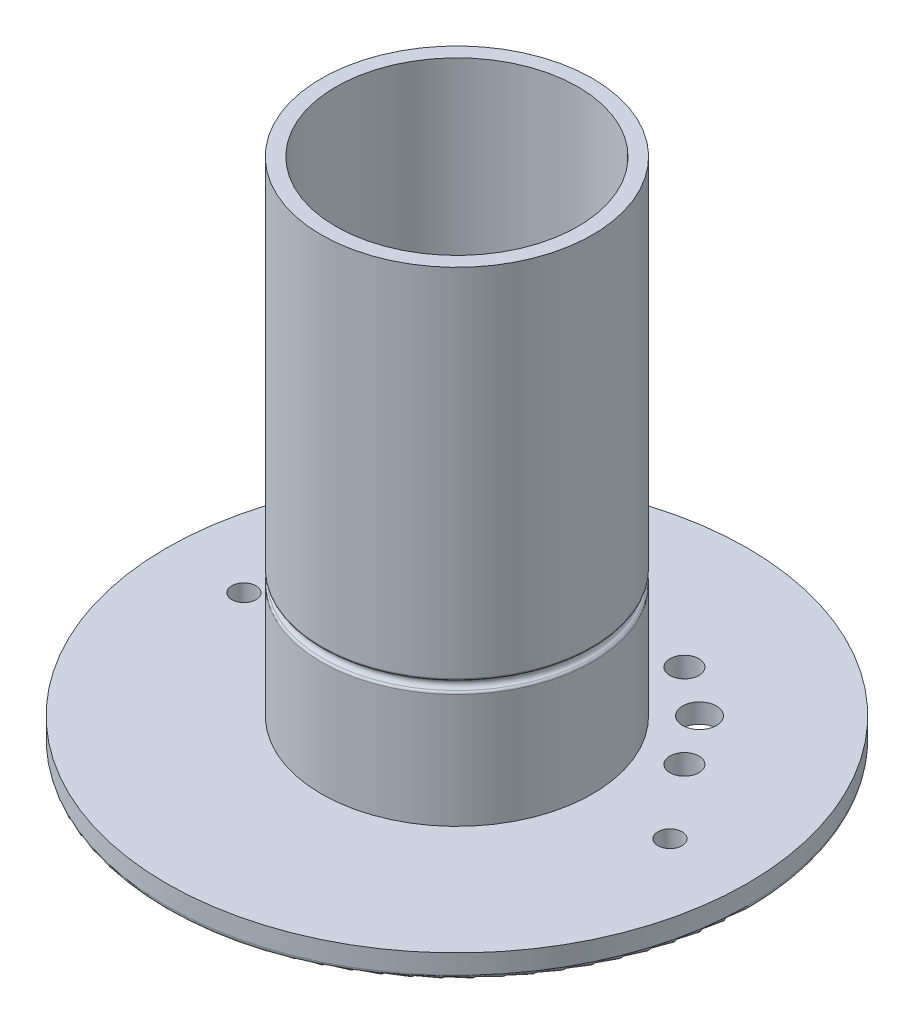
ISO-10303-21;
HEADER;
FILE_DESCRIPTION(('STEP AP214'),'2;1');
FILE_NAME('part.step','',(''),(''),'','','');
FILE_SCHEMA(('AUTOMOTIVE_DESIGN { 1 0 10303 214 1 1 1 1 }'));
ENDSEC;
DATA;
#1=APPLICATION_CONTEXT('core data for automotive mechanical design processes');
#2=APPLICATION_PROTOCOL_DEFINITION('international standard','automotive_design',2000,#1);
#3=PRODUCT_CONTEXT('',#1,'mechanical');
#4=PRODUCT('Part','Part','',(#3));
#5=PRODUCT_RELATED_PRODUCT_CATEGORY('part','',(#4));
#6=PRODUCT_DEFINITION_FORMATION('','',#4);
#7=PRODUCT_DEFINITION_CONTEXT('part definition',#1,'design');
#8=PRODUCT_DEFINITION('design','',#6,#7);
#9=PRODUCT_DEFINITION_SHAPE('','',#8);
#10=(LENGTH_UNIT() NAMED_UNIT(*) SI_UNIT(.MILLI.,.METRE.));
#11=(NAMED_UNIT(*) PLANE_ANGLE_UNIT() SI_UNIT($,.RADIAN.));
#12=(NAMED_UNIT(*) SI_UNIT($,.STERADIAN.) SOLID_ANGLE_UNIT());
#13=UNCERTAINTY_MEASURE_WITH_UNIT(LENGTH_MEASURE(1.E-05),#10,'distance_accuracy_value','');
#14=(GEOMETRIC_REPRESENTATION_CONTEXT(3) GLOBAL_UNCERTAINTY_ASSIGNED_CONTEXT((#13)) GLOBAL_UNIT_ASSIGNED_CONTEXT((#10,
#11,#12)) REPRESENTATION_CONTEXT('',''));
#15=CARTESIAN_POINT('',(0.,0.,0.));
#16=DIRECTION('',(0.,0.,1.));
#17=DIRECTION('',(1.,0.,0.));
#18=AXIS2_PLACEMENT_3D('',#15,#16,#17);
#19=CARTESIAN_POINT('',(-14.7905338401467,5.,-32.1906513456729));
#20=DIRECTION('',(0.,-1.,0.));
#21=DIRECTION('',(0.,0.,-1.));
#22=AXIS2_PLACEMENT_3D('',#19,#20,#21);
#23=CYLINDRICAL_SURFACE('',#22,3.);
#24=CARTESIAN_POINT('',(-14.7905338401467,5.,-32.1906513456729));
#25=DIRECTION('',(0.,-1.,0.));
#26=DIRECTION('',(0.,0.,-1.));
#27=AXIS2_PLACEMENT_3D('',#24,#25,#26);
#28=CIRCLE('',#27,3.);
#29=CARTESIAN_POINT('',(-14.7905338401467,5.,-35.190651345673));
#30=VERTEX_POINT('',#29);
#31=EDGE_CURVE('E108',#30,#30,#28,.T.);
#32=ORIENTED_EDGE('',*,*,#31,.F.);
#33=EDGE_LOOP('',(#32));
#34=FACE_BOUND('',#33,.T.);
#35=CARTESIAN_POINT('',(-14.7905338401467,2.,-32.1906513456729));
#36=DIRECTION('',(0.,-1.,0.));
#37=DIRECTION('',(0.,0.,-1.));
#38=AXIS2_PLACEMENT_3D('',#35,#36,#37);
#39=CIRCLE('',#38,3.);
#40=CARTESIAN_POINT('',(-14.7905338401467,2.,-35.190651345673));
#41=VERTEX_POINT('',#40);
#42=EDGE_CURVE('E41',#41,#41,#39,.F.);
#43=ORIENTED_EDGE('',*,*,#42,.F.);
#44=EDGE_LOOP('',(#43));
#45=FACE_BOUND('',#44,.T.);
#46=ADVANCED_FACE('F37',(#34,#45),#23,.F.);
#47=CARTESIAN_POINT('',(-32.1919899224737,5.,-14.7876201657519));
#48=DIRECTION('',(0.,-1.,0.));
#49=DIRECTION('',(0.,0.,-1.));
#50=AXIS2_PLACEMENT_3D('',#47,#48,#49);
#51=CYLINDRICAL_SURFACE('',#50,3.);
#52=CARTESIAN_POINT('',(-32.1919899224737,5.,-14.7876201657519));
#53=DIRECTION('',(0.,-1.,0.));
#54=DIRECTION('',(0.,0.,-1.));
#55=AXIS2_PLACEMENT_3D('',#52,#53,#54);
#56=CIRCLE('',#55,3.);
#57=CARTESIAN_POINT('',(-32.1919899224737,5.,-17.7876201657519));
#58=VERTEX_POINT('',#57);
#59=EDGE_CURVE('E60',#58,#58,#56,.T.);
#60=ORIENTED_EDGE('',*,*,#59,.F.);
#61=EDGE_LOOP('',(#60));
#62=FACE_BOUND('',#61,.T.);
#63=CARTESIAN_POINT('',(-32.1919899224737,2.,-14.7876201657519));
#64=DIRECTION('',(0.,-1.,0.));
#65=DIRECTION('',(0.,0.,-1.));
#66=AXIS2_PLACEMENT_3D('',#63,#64,#65);
#67=CIRCLE('',#66,3.);
#68=CARTESIAN_POINT('',(-32.1919899224737,2.,-17.7876201657519));
#69=VERTEX_POINT('',#68);
#70=EDGE_CURVE('E61',#69,#69,#67,.F.);
#71=ORIENTED_EDGE('',*,*,#70,.F.);
#72=EDGE_LOOP('',(#71));
#73=FACE_BOUND('',#72,.T.);
#74=ADVANCED_FACE('F178',(#62,#73),#51,.F.);
#75=CARTESIAN_POINT('',(-25.0503137137507,5.,-25.0501389729372));
#76=DIRECTION('',(0.,-1.,0.));
#77=DIRECTION('',(0.,0.,-1.));
#78=AXIS2_PLACEMENT_3D('',#75,#76,#77);
#79=CYLINDRICAL_SURFACE('',#78,3.5);
#80=CARTESIAN_POINT('',(-25.0503137137507,5.,-25.0501389729372));
#81=DIRECTION('',(0.,-1.,0.));
#82=DIRECTION('',(0.,0.,-1.));
#83=AXIS2_PLACEMENT_3D('',#80,#81,#82);
#84=CIRCLE('',#83,3.5);
#85=CARTESIAN_POINT('',(-25.0503137137507,5.,-28.5501389729372));
#86=VERTEX_POINT('',#85);
#87=EDGE_CURVE('E95',#86,#86,#84,.T.);
#88=ORIENTED_EDGE('',*,*,#87,.F.);
#89=EDGE_LOOP('',(#88));
#90=FACE_BOUND('',#89,.T.);
#91=CARTESIAN_POINT('',(-25.0503137137507,1.,-25.0501389729372));
#92=DIRECTION('',(0.,-1.,0.));
#93=DIRECTION('',(0.,0.,-1.));
#94=AXIS2_PLACEMENT_3D('',#91,#92,#93);
#95=CIRCLE('',#94,3.5);
#96=CARTESIAN_POINT('',(-25.0503137137507,1.,-28.5501389729372));
#97=VERTEX_POINT('',#96);
#98=EDGE_CURVE('E57',#97,#97,#95,.F.);
#99=ORIENTED_EDGE('',*,*,#98,.F.);
#100=EDGE_LOOP('',(#99));
#101=FACE_BOUND('',#100,.T.);
#102=ADVANCED_FACE('F184',(#90,#101),#79,.F.);
#103=CARTESIAN_POINT('',(25.0520560049759,5.,-25.0478026033972));
#104=DIRECTION('',(0.,-1.,0.));
#105=DIRECTION('',(0.,0.,-1.));
#106=AXIS2_PLACEMENT_3D('',#103,#104,#105);
#107=CYLINDRICAL_SURFACE('',#106,3.5);
#108=CARTESIAN_POINT('',(25.0520560049759,5.,-25.0478026033972));
#109=DIRECTION('',(0.,-1.,0.));
#110=DIRECTION('',(0.,0.,-1.));
#111=AXIS2_PLACEMENT_3D('',#108,#109,#110);
#112=CIRCLE('',#111,3.5);
#113=CARTESIAN_POINT('',(25.0520560049759,5.,-28.5478026033972));
#114=VERTEX_POINT('',#113);
#115=EDGE_CURVE('E92',#114,#114,#112,.T.);
#116=ORIENTED_EDGE('',*,*,#115,.F.);
#117=EDGE_LOOP('',(#116));
#118=FACE_BOUND('',#117,.T.);
#119=CARTESIAN_POINT('',(25.0520560049759,1.,-25.0478026033972));
#120=DIRECTION('',(0.,-1.,0.));
#121=DIRECTION('',(0.,0.,-1.));
#122=AXIS2_PLACEMENT_3D('',#119,#120,#121);
#123=CIRCLE('',#122,3.5);
#124=CARTESIAN_POINT('',(25.0520560049759,1.,-28.5478026033972));
#125=VERTEX_POINT('',#124);
#126=EDGE_CURVE('E54',#125,#125,#123,.F.);
#127=ORIENTED_EDGE('',*,*,#126,.F.);
#128=EDGE_LOOP('',(#127));
#129=FACE_BOUND('',#128,.T.);
#130=ADVANCED_FACE('F193',(#118,#129),#107,.F.);
#131=CARTESIAN_POINT('',(0.,105.,0.));
#132=DIRECTION('',(0.,-1.,0.));
#133=DIRECTION('',(0.,0.,-1.));
#134=AXIS2_PLACEMENT_3D('',#131,#132,#133);
#135=CYLINDRICAL_SURFACE('',#134,28.);
#136=CARTESIAN_POINT('',(0.,31.4142135623731,0.));
#137=DIRECTION('',(0.,1.,0.));
#138=DIRECTION('',(0.,0.,1.));
#139=AXIS2_PLACEMENT_3D('',#136,#137,#138);
#140=CIRCLE('',#139,28.);
#141=CARTESIAN_POINT('',(0.,31.4142135623731,28.));
#142=VERTEX_POINT('',#141);
#143=EDGE_CURVE('E10',#142,#142,#140,.T.);
#144=ORIENTED_EDGE('',*,*,#143,.T.);
#145=EDGE_LOOP('',(#144));
#146=FACE_BOUND('',#145,.T.);
#147=CARTESIAN_POINT('',(0.,105.,0.));
#148=DIRECTION('',(0.,1.,0.));
#149=DIRECTION('',(0.,0.,1.));
#150=AXIS2_PLACEMENT_3D('',#147,#148,#149);
#151=CIRCLE('',#150,28.);
#152=CARTESIAN_POINT('',(0.,105.,28.));
#153=VERTEX_POINT('',#152);
#154=EDGE_CURVE('E122',#153,#153,#151,.T.);
#155=ORIENTED_EDGE('',*,*,#154,.F.);
#156=EDGE_LOOP('',(#155));
#157=FACE_BOUND('',#156,.T.);
#158=ADVANCED_FACE('F198',(#146,#157),#135,.T.);
#159=CARTESIAN_POINT('',(0.,28.5857864376269,0.));
#160=DIRECTION('',(0.,-1.,0.));
#161=DIRECTION('',(0.,0.,-1.));
#162=AXIS2_PLACEMENT_3D('',#159,#160,#161);
#163=CIRCLE('',#162,28.);
#164=CARTESIAN_POINT('',(0.,28.5857864376269,-28.));
#165=VERTEX_POINT('',#164);
#166=EDGE_CURVE('E50',#165,#165,#163,.T.);
#167=ORIENTED_EDGE('',*,*,#166,.T.);
#168=EDGE_LOOP('',(#167));
#169=FACE_BOUND('',#168,.T.);
#170=CARTESIAN_POINT('',(0.,5.,0.));
#171=DIRECTION('',(0.,1.,0.));
#172=DIRECTION('',(0.,0.,1.));
#173=AXIS2_PLACEMENT_3D('',#170,#171,#172);
#174=CIRCLE('',#173,28.);
#175=CARTESIAN_POINT('',(0.,5.,28.));
#176=VERTEX_POINT('',#175);
#177=EDGE_CURVE('E119',#176,#176,#174,.T.);
#178=ORIENTED_EDGE('',*,*,#177,.T.);
#179=EDGE_LOOP('',(#178));
#180=FACE_BOUND('',#179,.T.);
#181=ADVANCED_FACE('F153',(#169,#180),#135,.T.);
#182=CARTESIAN_POINT('',(0.,5.,0.));
#183=DIRECTION('',(0.,-1.,0.));
#184=DIRECTION('',(0.,0.,-1.));
#185=AXIS2_PLACEMENT_3D('',#182,#183,#184);
#186=CYLINDRICAL_SURFACE('',#185,60.);
#187=CARTESIAN_POINT('',(0.,1.,0.));
#188=DIRECTION('',(0.,1.,0.));
#189=DIRECTION('',(0.,0.,1.));
#190=AXIS2_PLACEMENT_3D('',#187,#188,#189);
#191=CIRCLE('',#190,60.);
#192=CARTESIAN_POINT('',(0.,1.,60.));
#193=VERTEX_POINT('',#192);
#194=EDGE_CURVE('E142',#193,#193,#191,.T.);
#195=ORIENTED_EDGE('',*,*,#194,.T.);
#196=EDGE_LOOP('',(#195));
#197=FACE_BOUND('',#196,.T.);
#198=CARTESIAN_POINT('',(0.,5.,0.));
#199=DIRECTION('',(0.,1.,0.));
#200=DIRECTION('',(0.,0.,1.));
#201=AXIS2_PLACEMENT_3D('',#198,#199,#200);
#202=CIRCLE('',#201,60.);
#203=CARTESIAN_POINT('',(0.,5.,60.));
#204=VERTEX_POINT('',#203);
#205=EDGE_CURVE('E131',#204,#204,#202,.T.);
#206=ORIENTED_EDGE('',*,*,#205,.F.);
#207=EDGE_LOOP('',(#206));
#208=FACE_BOUND('',#207,.T.);
#209=ADVANCED_FACE('F263',(#197,#208),#186,.T.);
#210=CARTESIAN_POINT('',(0.,5.,0.));
#211=DIRECTION('',(0.,1.,0.));
#212=DIRECTION('',(0.,0.,1.));
#213=AXIS2_PLACEMENT_3D('',#210,#211,#212);
#214=PLANE('',#213);
#215=ORIENTED_EDGE('',*,*,#59,.T.);
#216=EDGE_LOOP('',(#215));
#217=FACE_BOUND('',#216,.T.);
#218=ORIENTED_EDGE('',*,*,#31,.T.);
#219=EDGE_LOOP('',(#218));
#220=FACE_BOUND('',#219,.T.);
#221=CARTESIAN_POINT('',(14.7930860542257,5.,-32.189478565635));
#222=DIRECTION('',(0.,-1.,0.));
#223=DIRECTION('',(0.,0.,-1.));
#224=AXIS2_PLACEMENT_3D('',#221,#222,#223);
#225=CIRCLE('',#224,3.);
#226=CARTESIAN_POINT('',(14.7930860542257,5.,-35.189478565635));
#227=VERTEX_POINT('',#226);
#228=EDGE_CURVE('E105',#227,#227,#225,.T.);
#229=ORIENTED_EDGE('',*,*,#228,.T.);
#230=EDGE_LOOP('',(#229));
#231=FACE_BOUND('',#230,.T.);
#232=CARTESIAN_POINT('',(32.1919899224737,5.,-14.7876201657519));
#233=DIRECTION('',(0.,-1.,0.));
#234=DIRECTION('',(0.,0.,-1.));
#235=AXIS2_PLACEMENT_3D('',#232,#233,#234);
#236=CIRCLE('',#235,3.);
#237=CARTESIAN_POINT('',(32.1919899224737,5.,-17.7876201657519));
#238=VERTEX_POINT('',#237);
#239=EDGE_CURVE('E99',#238,#238,#236,.T.);
#240=ORIENTED_EDGE('',*,*,#239,.T.);
#241=EDGE_LOOP('',(#240));
#242=FACE_BOUND('',#241,.T.);
#243=ORIENTED_EDGE('',*,*,#115,.T.);
#244=EDGE_LOOP('',(#243));
#245=FACE_BOUND('',#244,.T.);
#246=ORIENTED_EDGE('',*,*,#87,.T.);
#247=EDGE_LOOP('',(#246));
#248=FACE_BOUND('',#247,.T.);
#249=ORIENTED_EDGE('',*,*,#177,.F.);
#250=EDGE_LOOP('',(#249));
#251=FACE_BOUND('',#250,.T.);
#252=CARTESIAN_POINT('',(-44.,5.,0.));
#253=DIRECTION('',(0.,1.,0.));
#254=DIRECTION('',(0.,0.,1.));
#255=AXIS2_PLACEMENT_3D('',#252,#253,#254);
#256=CIRCLE('',#255,2.5);
#257=CARTESIAN_POINT('',(-44.,5.,2.5));
#258=VERTEX_POINT('',#257);
#259=EDGE_CURVE('E132',#258,#258,#256,.T.);
#260=ORIENTED_EDGE('',*,*,#259,.F.);
#261=EDGE_LOOP('',(#260));
#262=FACE_BOUND('',#261,.T.);
#263=CARTESIAN_POINT('',(44.,5.,0.));
#264=DIRECTION('',(0.,1.,0.));
#265=DIRECTION('',(0.,0.,1.));
#266=AXIS2_PLACEMENT_3D('',#263,#264,#265);
#267=CIRCLE('',#266,2.5);
#268=CARTESIAN_POINT('',(44.,5.,2.5));
#269=VERTEX_POINT('',#268);
#270=EDGE_CURVE('E135',#269,#269,#267,.T.);
#271=ORIENTED_EDGE('',*,*,#270,.F.);
#272=EDGE_LOOP('',(#271));
#273=FACE_BOUND('',#272,.T.);
#274=ORIENTED_EDGE('',*,*,#205,.T.);
#275=EDGE_LOOP('',(#274));
#276=FACE_BOUND('',#275,.T.);
#277=ADVANCED_FACE('F244',(#217,#220,#231,#242,#245,#248,#251,#262,#273,#276),#214,.T.);
#278=CARTESIAN_POINT('',(0.,0.,0.));
#279=DIRECTION('',(0.,1.,0.));
#280=DIRECTION('',(0.,0.,1.));
#281=AXIS2_PLACEMENT_3D('',#278,#279,#280);
#282=PLANE('',#281);
#283=CARTESIAN_POINT('',(-32.1919899224737,0.,-14.7876201657519));
#284=DIRECTION('',(0.,-1.,0.));
#285=DIRECTION('',(0.,0.,-1.));
#286=AXIS2_PLACEMENT_3D('',#283,#284,#285);
#287=CIRCLE('',#286,5.);
#288=CARTESIAN_POINT('',(-32.1919899224737,0.,-19.7876201657519));
#289=VERTEX_POINT('',#288);
#290=EDGE_CURVE('E69',#289,#289,#287,.T.);
#291=ORIENTED_EDGE('',*,*,#290,.F.);
#292=EDGE_LOOP('',(#291));
#293=FACE_BOUND('',#292,.T.);
#294=CARTESIAN_POINT('',(-14.7905338401467,0.,-32.1906513456729));
#295=DIRECTION('',(0.,-1.,0.));
#296=DIRECTION('',(0.,0.,-1.));
#297=AXIS2_PLACEMENT_3D('',#294,#295,#296);
#298=CIRCLE('',#297,5.);
#299=CARTESIAN_POINT('',(-14.7905338401467,0.,-37.1906513456729));
#300=VERTEX_POINT('',#299);
#301=EDGE_CURVE('E74',#300,#300,#298,.T.);
#302=ORIENTED_EDGE('',*,*,#301,.F.);
#303=EDGE_LOOP('',(#302));
#304=FACE_BOUND('',#303,.T.);
#305=CARTESIAN_POINT('',(-25.0503137137507,0.,-25.0501389729372));
#306=DIRECTION('',(0.,-1.,0.));
#307=DIRECTION('',(0.,0.,-1.));
#308=AXIS2_PLACEMENT_3D('',#305,#306,#307);
#309=CIRCLE('',#308,5.);
#310=CARTESIAN_POINT('',(-25.0503137137507,0.,-30.0501389729372));
#311=VERTEX_POINT('',#310);
#312=EDGE_CURVE('E84',#311,#311,#309,.T.);
#313=ORIENTED_EDGE('',*,*,#312,.F.);
#314=EDGE_LOOP('',(#313));
#315=FACE_BOUND('',#314,.T.);
#316=CARTESIAN_POINT('',(25.0520560049759,0.,-25.0478026033972));
#317=DIRECTION('',(0.,-1.,0.));
#318=DIRECTION('',(0.,0.,-1.));
#319=AXIS2_PLACEMENT_3D('',#316,#317,#318);
#320=CIRCLE('',#319,5.);
#321=CARTESIAN_POINT('',(25.0520560049759,0.,-30.0478026033972));
#322=VERTEX_POINT('',#321);
#323=EDGE_CURVE('E87',#322,#322,#320,.T.);
#324=ORIENTED_EDGE('',*,*,#323,.F.);
#325=EDGE_LOOP('',(#324));
#326=FACE_BOUND('',#325,.T.);
#327=CARTESIAN_POINT('',(14.7930860542257,0.,-32.189478565635));
#328=DIRECTION('',(0.,-1.,0.));
#329=DIRECTION('',(0.,0.,-1.));
#330=AXIS2_PLACEMENT_3D('',#327,#328,#329);
#331=CIRCLE('',#330,3.);
#332=CARTESIAN_POINT('',(14.7930860542257,0.,-35.189478565635));
#333=VERTEX_POINT('',#332);
#334=EDGE_CURVE('E102',#333,#333,#331,.T.);
#335=ORIENTED_EDGE('',*,*,#334,.F.);
#336=EDGE_LOOP('',(#335));
#337=FACE_BOUND('',#336,.T.);
#338=CARTESIAN_POINT('',(32.1919899224737,0.,-14.7876201657519));
#339=DIRECTION('',(0.,-1.,0.));
#340=DIRECTION('',(0.,0.,-1.));
#341=AXIS2_PLACEMENT_3D('',#338,#339,#340);
#342=CIRCLE('',#341,3.);
#343=CARTESIAN_POINT('',(32.1919899224737,0.,-17.7876201657519));
#344=VERTEX_POINT('',#343);
#345=EDGE_CURVE('E96',#344,#344,#342,.T.);
#346=ORIENTED_EDGE('',*,*,#345,.F.);
#347=EDGE_LOOP('',(#346));
#348=FACE_BOUND('',#347,.T.);
#349=CARTESIAN_POINT('',(0.,0.,0.));
#350=DIRECTION('',(0.,1.,0.));
#351=DIRECTION('',(0.,0.,1.));
#352=AXIS2_PLACEMENT_3D('',#349,#350,#351);
#353=CIRCLE('',#352,59.);
#354=CARTESIAN_POINT('',(0.,0.,59.));
#355=VERTEX_POINT('',#354);
#356=EDGE_CURVE('E145',#355,#355,#353,.F.);
#357=ORIENTED_EDGE('',*,*,#356,.T.);
#358=EDGE_LOOP('',(#357));
#359=FACE_BOUND('',#358,.T.);
#360=CARTESIAN_POINT('',(0.,0.,0.));
#361=DIRECTION('',(0.,1.,0.));
#362=DIRECTION('',(0.,0.,1.));
#363=AXIS2_PLACEMENT_3D('',#360,#361,#362);
#364=CIRCLE('',#363,25.);
#365=CARTESIAN_POINT('',(0.,0.,25.));
#366=VERTEX_POINT('',#365);
#367=EDGE_CURVE('E116',#366,#366,#364,.T.);
#368=ORIENTED_EDGE('',*,*,#367,.T.);
#369=EDGE_LOOP('',(#368));
#370=FACE_BOUND('',#369,.T.);
#371=CARTESIAN_POINT('',(-44.,0.,0.));
#372=DIRECTION('',(0.,1.,0.));
#373=DIRECTION('',(0.,0.,1.));
#374=AXIS2_PLACEMENT_3D('',#371,#372,#373);
#375=CIRCLE('',#374,2.5);
#376=CARTESIAN_POINT('',(-44.,0.,2.5));
#377=VERTEX_POINT('',#376);
#378=EDGE_CURVE('E128',#377,#377,#375,.T.);
#379=ORIENTED_EDGE('',*,*,#378,.T.);
#380=EDGE_LOOP('',(#379));
#381=FACE_BOUND('',#380,.T.);
#382=CARTESIAN_POINT('',(44.,0.,0.));
#383=DIRECTION('',(0.,1.,0.));
#384=DIRECTION('',(0.,0.,1.));
#385=AXIS2_PLACEMENT_3D('',#382,#383,#384);
#386=CIRCLE('',#385,2.5);
#387=CARTESIAN_POINT('',(44.,0.,2.5));
#388=VERTEX_POINT('',#387);
#389=EDGE_CURVE('E125',#388,#388,#386,.T.);
#390=ORIENTED_EDGE('',*,*,#389,.T.);
#391=EDGE_LOOP('',(#390));
#392=FACE_BOUND('',#391,.T.);
#393=ADVANCED_FACE('F240',(#293,#304,#315,#326,#337,#348,#359,#370,#381,#392),#282,.F.);
#394=CARTESIAN_POINT('',(44.,0.,0.));
#395=DIRECTION('',(0.,1.,0.));
#396=DIRECTION('',(0.,0.,1.));
#397=AXIS2_PLACEMENT_3D('',#394,#395,#396);
#398=CYLINDRICAL_SURFACE('',#397,2.5);
#399=ORIENTED_EDGE('',*,*,#389,.F.);
#400=EDGE_LOOP('',(#399));
#401=FACE_BOUND('',#400,.T.);
#402=ORIENTED_EDGE('',*,*,#270,.T.);
#403=EDGE_LOOP('',(#402));
#404=FACE_BOUND('',#403,.T.);
#405=ADVANCED_FACE('F243',(#401,#404),#398,.F.);
#406=CARTESIAN_POINT('',(-44.,0.,0.));
#407=DIRECTION('',(0.,1.,0.));
#408=DIRECTION('',(0.,0.,1.));
#409=AXIS2_PLACEMENT_3D('',#406,#407,#408);
#410=CYLINDRICAL_SURFACE('',#409,2.5);
#411=ORIENTED_EDGE('',*,*,#378,.F.);
#412=EDGE_LOOP('',(#411));
#413=FACE_BOUND('',#412,.T.);
#414=ORIENTED_EDGE('',*,*,#259,.T.);
#415=EDGE_LOOP('',(#414));
#416=FACE_BOUND('',#415,.T.);
#417=ADVANCED_FACE('F257',(#413,#416),#410,.F.);
#418=CARTESIAN_POINT('',(0.,105.,0.));
#419=DIRECTION('',(0.,1.,0.));
#420=DIRECTION('',(0.,0.,1.));
#421=AXIS2_PLACEMENT_3D('',#418,#419,#420);
#422=PLANE('',#421);
#423=CARTESIAN_POINT('',(0.,105.,0.));
#424=DIRECTION('',(0.,1.,0.));
#425=DIRECTION('',(0.,0.,1.));
#426=AXIS2_PLACEMENT_3D('',#423,#424,#425);
#427=CIRCLE('',#426,25.);
#428=CARTESIAN_POINT('',(0.,105.,25.));
#429=VERTEX_POINT('',#428);
#430=EDGE_CURVE('E115',#429,#429,#427,.T.);
#431=ORIENTED_EDGE('',*,*,#430,.F.);
#432=EDGE_LOOP('',(#431));
#433=FACE_BOUND('',#432,.T.);
#434=ORIENTED_EDGE('',*,*,#154,.T.);
#435=EDGE_LOOP('',(#434));
#436=FACE_BOUND('',#435,.T.);
#437=ADVANCED_FACE('F173',(#433,#436),#422,.T.);
#438=CARTESIAN_POINT('',(0.,0.,0.));
#439=DIRECTION('',(0.,1.,0.));
#440=DIRECTION('',(0.,0.,1.));
#441=AXIS2_PLACEMENT_3D('',#438,#439,#440);
#442=CYLINDRICAL_SURFACE('',#441,25.);
#443=ORIENTED_EDGE('',*,*,#367,.F.);
#444=EDGE_LOOP('',(#443));
#445=FACE_BOUND('',#444,.T.);
#446=ORIENTED_EDGE('',*,*,#430,.T.);
#447=EDGE_LOOP('',(#446));
#448=FACE_BOUND('',#447,.T.);
#449=ADVANCED_FACE('F164',(#445,#448),#442,.F.);
#450=CARTESIAN_POINT('',(0.,30.,0.));
#451=DIRECTION('',(0.,1.,0.));
#452=DIRECTION('',(0.,0.,1.));
#453=AXIS2_PLACEMENT_3D('',#450,#451,#452);
#454=TOROIDAL_SURFACE('',#453,28.,1.);
#455=CARTESIAN_POINT('',(0.,30.9428090415829,0.));
#456=DIRECTION('',(0.,-1.,0.));
#457=DIRECTION('',(0.,0.,-1.));
#458=AXIS2_PLACEMENT_3D('',#455,#456,#457);
#459=CIRCLE('',#458,27.6666666666664);
#460=CARTESIAN_POINT('',(0.,30.9428090415829,-27.6666666666664));
#461=VERTEX_POINT('',#460);
#462=EDGE_CURVE('E45',#461,#461,#459,.T.);
#463=ORIENTED_EDGE('',*,*,#462,.T.);
#464=EDGE_LOOP('',(#463));
#465=FACE_BOUND('',#464,.T.);
#466=CARTESIAN_POINT('',(0.,29.0571909584166,0.));
#467=DIRECTION('',(0.,1.,0.));
#468=DIRECTION('',(0.,0.,1.));
#469=AXIS2_PLACEMENT_3D('',#466,#467,#468);
#470=CIRCLE('',#469,27.6666666666662);
#471=CARTESIAN_POINT('',(0.,29.0571909584166,27.6666666666662));
#472=VERTEX_POINT('',#471);
#473=EDGE_CURVE('E148',#472,#472,#470,.T.);
#474=ORIENTED_EDGE('',*,*,#473,.T.);
#475=EDGE_LOOP('',(#474));
#476=FACE_BOUND('',#475,.T.);
#477=ADVANCED_FACE('F162',(#465,#476),#454,.F.);
#478=CARTESIAN_POINT('',(0.,1.,0.));
#479=DIRECTION('',(0.,1.,0.));
#480=DIRECTION('',(0.,0.,1.));
#481=AXIS2_PLACEMENT_3D('',#478,#479,#480);
#482=TOROIDAL_SURFACE('',#481,59.,1.);
#483=ORIENTED_EDGE('',*,*,#356,.F.);
#484=EDGE_LOOP('',(#483));
#485=FACE_BOUND('',#484,.T.);
#486=ORIENTED_EDGE('',*,*,#194,.F.);
#487=EDGE_LOOP('',(#486));
#488=FACE_BOUND('',#487,.T.);
#489=ADVANCED_FACE('F159',(#485,#488),#482,.T.);
#490=CARTESIAN_POINT('',(0.,28.5857864376269,0.));
#491=DIRECTION('',(0.,-1.,0.));
#492=DIRECTION('',(0.,0.,-1.));
#493=AXIS2_PLACEMENT_3D('',#490,#491,#492);
#494=TOROIDAL_SURFACE('',#493,27.5,0.5);
#495=ORIENTED_EDGE('',*,*,#166,.F.);
#496=EDGE_LOOP('',(#495));
#497=FACE_BOUND('',#496,.T.);
#498=ORIENTED_EDGE('',*,*,#473,.F.);
#499=EDGE_LOOP('',(#498));
#500=FACE_BOUND('',#499,.T.);
#501=ADVANCED_FACE('F156',(#497,#500),#494,.T.);
#502=CARTESIAN_POINT('',(0.,31.4142135623731,0.));
#503=DIRECTION('',(0.,1.,0.));
#504=DIRECTION('',(0.,0.,1.));
#505=AXIS2_PLACEMENT_3D('',#502,#503,#504);
#506=TOROIDAL_SURFACE('',#505,27.5,0.5);
#507=ORIENTED_EDGE('',*,*,#143,.F.);
#508=EDGE_LOOP('',(#507));
#509=FACE_BOUND('',#508,.T.);
#510=ORIENTED_EDGE('',*,*,#462,.F.);
#511=EDGE_LOOP('',(#510));
#512=FACE_BOUND('',#511,.T.);
#513=ADVANCED_FACE('F39',(#509,#512),#506,.T.);
#514=CARTESIAN_POINT('',(32.1919899224737,5.,-14.7876201657519));
#515=DIRECTION('',(0.,-1.,0.));
#516=DIRECTION('',(0.,0.,-1.));
#517=AXIS2_PLACEMENT_3D('',#514,#515,#516);
#518=CYLINDRICAL_SURFACE('',#517,3.);
#519=ORIENTED_EDGE('',*,*,#239,.F.);
#520=EDGE_LOOP('',(#519));
#521=FACE_BOUND('',#520,.T.);
#522=ORIENTED_EDGE('',*,*,#345,.T.);
#523=EDGE_LOOP('',(#522));
#524=FACE_BOUND('',#523,.T.);
#525=ADVANCED_FACE('F227',(#521,#524),#518,.F.);
#526=CARTESIAN_POINT('',(14.7930860542257,5.,-32.189478565635));
#527=DIRECTION('',(0.,-1.,0.));
#528=DIRECTION('',(0.,0.,-1.));
#529=AXIS2_PLACEMENT_3D('',#526,#527,#528);
#530=CYLINDRICAL_SURFACE('',#529,3.);
#531=ORIENTED_EDGE('',*,*,#228,.F.);
#532=EDGE_LOOP('',(#531));
#533=FACE_BOUND('',#532,.T.);
#534=ORIENTED_EDGE('',*,*,#334,.T.);
#535=EDGE_LOOP('',(#534));
#536=FACE_BOUND('',#535,.T.);
#537=ADVANCED_FACE('F190',(#533,#536),#530,.F.);
#538=CARTESIAN_POINT('',(25.0520560049759,1.,-25.0478026033972));
#539=DIRECTION('',(0.,-1.,0.));
#540=DIRECTION('',(0.,0.,-1.));
#541=AXIS2_PLACEMENT_3D('',#538,#539,#540);
#542=PLANE('',#541);
#543=CARTESIAN_POINT('',(25.0520560049759,1.,-25.0478026033972));
#544=DIRECTION('',(0.,-1.,0.));
#545=DIRECTION('',(0.,0.,-1.));
#546=AXIS2_PLACEMENT_3D('',#543,#544,#545);
#547=CIRCLE('',#546,5.);
#548=CARTESIAN_POINT('',(25.0520560049759,1.,-30.0478026033972));
#549=VERTEX_POINT('',#548);
#550=EDGE_CURVE('E67',#549,#549,#547,.T.);
#551=ORIENTED_EDGE('',*,*,#550,.T.);
#552=EDGE_LOOP('',(#551));
#553=FACE_BOUND('',#552,.T.);
#554=ORIENTED_EDGE('',*,*,#126,.T.);
#555=EDGE_LOOP('',(#554));
#556=FACE_BOUND('',#555,.T.);
#557=ADVANCED_FACE('F218',(#553,#556),#542,.T.);
#558=CARTESIAN_POINT('',(25.0520560049759,1.,-25.0478026033972));
#559=DIRECTION('',(0.,-1.,0.));
#560=DIRECTION('',(0.,0.,-1.));
#561=AXIS2_PLACEMENT_3D('',#558,#559,#560);
#562=CYLINDRICAL_SURFACE('',#561,5.);
#563=ORIENTED_EDGE('',*,*,#550,.F.);
#564=EDGE_LOOP('',(#563));
#565=FACE_BOUND('',#564,.T.);
#566=ORIENTED_EDGE('',*,*,#323,.T.);
#567=EDGE_LOOP('',(#566));
#568=FACE_BOUND('',#567,.T.);
#569=ADVANCED_FACE('F208',(#565,#568),#562,.F.);
#570=CARTESIAN_POINT('',(-25.0503137137507,1.,-25.0501389729372));
#571=DIRECTION('',(0.,-1.,0.));
#572=DIRECTION('',(0.,0.,-1.));
#573=AXIS2_PLACEMENT_3D('',#570,#571,#572);
#574=PLANE('',#573);
#575=CARTESIAN_POINT('',(-25.0503137137507,1.,-25.0501389729372));
#576=DIRECTION('',(0.,-1.,0.));
#577=DIRECTION('',(0.,0.,-1.));
#578=AXIS2_PLACEMENT_3D('',#575,#576,#577);
#579=CIRCLE('',#578,5.);
#580=CARTESIAN_POINT('',(-25.0503137137507,1.,-30.0501389729372));
#581=VERTEX_POINT('',#580);
#582=EDGE_CURVE('E58',#581,#581,#579,.T.);
#583=ORIENTED_EDGE('',*,*,#582,.T.);
#584=EDGE_LOOP('',(#583));
#585=FACE_BOUND('',#584,.T.);
#586=ORIENTED_EDGE('',*,*,#98,.T.);
#587=EDGE_LOOP('',(#586));
#588=FACE_BOUND('',#587,.T.);
#589=ADVANCED_FACE('F205',(#585,#588),#574,.T.);
#590=CARTESIAN_POINT('',(-25.0503137137507,1.,-25.0501389729372));
#591=DIRECTION('',(0.,-1.,0.));
#592=DIRECTION('',(0.,0.,-1.));
#593=AXIS2_PLACEMENT_3D('',#590,#591,#592);
#594=CYLINDRICAL_SURFACE('',#593,5.);
#595=ORIENTED_EDGE('',*,*,#582,.F.);
#596=EDGE_LOOP('',(#595));
#597=FACE_BOUND('',#596,.T.);
#598=ORIENTED_EDGE('',*,*,#312,.T.);
#599=EDGE_LOOP('',(#598));
#600=FACE_BOUND('',#599,.T.);
#601=ADVANCED_FACE('F207',(#597,#600),#594,.F.);
#602=CARTESIAN_POINT('',(-32.1919899224737,2.,-14.7876201657519));
#603=DIRECTION('',(0.,-1.,0.));
#604=DIRECTION('',(0.,0.,-1.));
#605=AXIS2_PLACEMENT_3D('',#602,#603,#604);
#606=PLANE('',#605);
#607=CARTESIAN_POINT('',(-32.1919899224737,2.,-14.7876201657519));
#608=DIRECTION('',(0.,-1.,0.));
#609=DIRECTION('',(0.,0.,-1.));
#610=AXIS2_PLACEMENT_3D('',#607,#608,#609);
#611=CIRCLE('',#610,5.);
#612=CARTESIAN_POINT('',(-32.1919899224737,2.,-19.7876201657519));
#613=VERTEX_POINT('',#612);
#614=EDGE_CURVE('E63',#613,#613,#611,.T.);
#615=ORIENTED_EDGE('',*,*,#614,.T.);
#616=EDGE_LOOP('',(#615));
#617=FACE_BOUND('',#616,.T.);
#618=ORIENTED_EDGE('',*,*,#70,.T.);
#619=EDGE_LOOP('',(#618));
#620=FACE_BOUND('',#619,.T.);
#621=ADVANCED_FACE('F215',(#617,#620),#606,.T.);
#622=CARTESIAN_POINT('',(-32.1919899224737,2.,-14.7876201657519));
#623=DIRECTION('',(0.,-1.,0.));
#624=DIRECTION('',(0.,0.,-1.));
#625=AXIS2_PLACEMENT_3D('',#622,#623,#624);
#626=CYLINDRICAL_SURFACE('',#625,5.);
#627=ORIENTED_EDGE('',*,*,#614,.F.);
#628=EDGE_LOOP('',(#627));
#629=FACE_BOUND('',#628,.T.);
#630=ORIENTED_EDGE('',*,*,#290,.T.);
#631=EDGE_LOOP('',(#630));
#632=FACE_BOUND('',#631,.T.);
#633=ADVANCED_FACE('F357',(#629,#632),#626,.F.);
#634=CARTESIAN_POINT('',(-14.7905338401467,2.,-32.1906513456729));
#635=DIRECTION('',(0.,-1.,0.));
#636=DIRECTION('',(0.,0.,-1.));
#637=AXIS2_PLACEMENT_3D('',#634,#635,#636);
#638=PLANE('',#637);
#639=CARTESIAN_POINT('',(-14.7905338401467,2.,-32.1906513456729));
#640=DIRECTION('',(0.,-1.,0.));
#641=DIRECTION('',(0.,0.,-1.));
#642=AXIS2_PLACEMENT_3D('',#639,#640,#641);
#643=CIRCLE('',#642,5.);
#644=CARTESIAN_POINT('',(-14.7905338401467,2.,-37.1906513456729));
#645=VERTEX_POINT('',#644);
#646=EDGE_CURVE('E79',#645,#645,#643,.T.);
#647=ORIENTED_EDGE('',*,*,#646,.T.);
#648=EDGE_LOOP('',(#647));
#649=FACE_BOUND('',#648,.T.);
#650=ORIENTED_EDGE('',*,*,#42,.T.);
#651=EDGE_LOOP('',(#650));
#652=FACE_BOUND('',#651,.T.);
#653=ADVANCED_FACE('F222',(#649,#652),#638,.T.);
#654=CARTESIAN_POINT('',(-14.7905338401467,2.,-32.1906513456729));
#655=DIRECTION('',(0.,-1.,0.));
#656=DIRECTION('',(0.,0.,-1.));
#657=AXIS2_PLACEMENT_3D('',#654,#655,#656);
#658=CYLINDRICAL_SURFACE('',#657,5.);
#659=ORIENTED_EDGE('',*,*,#646,.F.);
#660=EDGE_LOOP('',(#659));
#661=FACE_BOUND('',#660,.T.);
#662=ORIENTED_EDGE('',*,*,#301,.T.);
#663=EDGE_LOOP('',(#662));
#664=FACE_BOUND('',#663,.T.);
#665=ADVANCED_FACE('F378',(#661,#664),#658,.F.);
#666=CLOSED_SHELL('',(#46,#74,#102,#130,#158,#181,#209,#277,#393,#405,#417,#437,#449,#477,#489,
#501,#513,#525,#537,#557,#569,#589,#601,#621,#633,#653,#665));
#667=MANIFOLD_SOLID_BREP('B2',#666);
#668=ADVANCED_BREP_SHAPE_REPRESENTATION('',(#18,#667),#14);
#669=SHAPE_DEFINITION_REPRESENTATION(#9,#668);
ENDSEC;
END-ISO-10303-21;
